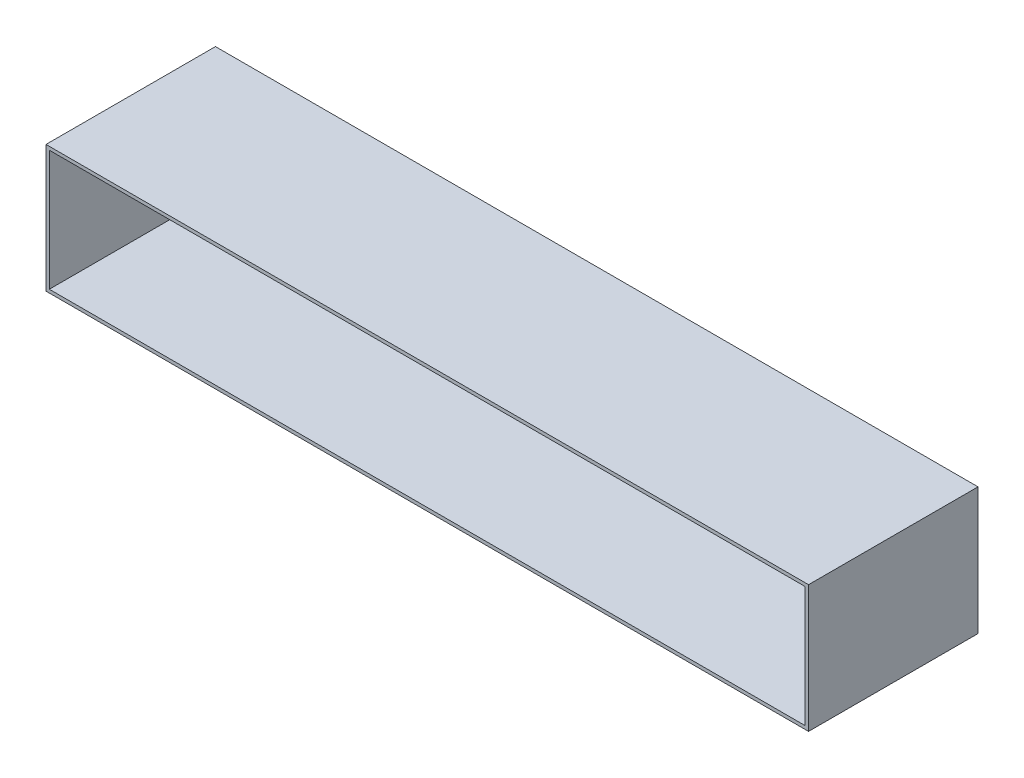
ISO-10303-21;
HEADER;
FILE_DESCRIPTION(('STEP AP214'),'2;1');
FILE_NAME('part.step','',(''),(''),'','','');
FILE_SCHEMA(('AUTOMOTIVE_DESIGN { 1 0 10303 214 1 1 1 1 }'));
ENDSEC;
DATA;
#1=APPLICATION_CONTEXT('core data for automotive mechanical design processes');
#2=APPLICATION_PROTOCOL_DEFINITION('international standard','automotive_design',2000,#1);
#3=PRODUCT_CONTEXT('',#1,'mechanical');
#4=PRODUCT('Part','Part','',(#3));
#5=PRODUCT_RELATED_PRODUCT_CATEGORY('part','',(#4));
#6=PRODUCT_DEFINITION_FORMATION('','',#4);
#7=PRODUCT_DEFINITION_CONTEXT('part definition',#1,'design');
#8=PRODUCT_DEFINITION('design','',#6,#7);
#9=PRODUCT_DEFINITION_SHAPE('','',#8);
#10=(LENGTH_UNIT() NAMED_UNIT(*) SI_UNIT(.MILLI.,.METRE.));
#11=(NAMED_UNIT(*) PLANE_ANGLE_UNIT() SI_UNIT($,.RADIAN.));
#12=(NAMED_UNIT(*) SI_UNIT($,.STERADIAN.) SOLID_ANGLE_UNIT());
#13=UNCERTAINTY_MEASURE_WITH_UNIT(LENGTH_MEASURE(1.E-05),#10,'distance_accuracy_value','');
#14=(GEOMETRIC_REPRESENTATION_CONTEXT(3) GLOBAL_UNCERTAINTY_ASSIGNED_CONTEXT((#13)) GLOBAL_UNIT_ASSIGNED_CONTEXT((#10,
#11,#12)) REPRESENTATION_CONTEXT('',''));
#15=CARTESIAN_POINT('',(0.,0.,0.));
#16=DIRECTION('',(0.,0.,1.));
#17=DIRECTION('',(1.,0.,0.));
#18=AXIS2_PLACEMENT_3D('',#15,#16,#17);
#19=CARTESIAN_POINT('',(0.,0.,50.8));
#20=DIRECTION('',(0.,0.,1.));
#21=DIRECTION('',(1.,0.,0.));
#22=AXIS2_PLACEMENT_3D('',#19,#20,#21);
#23=PLANE('',#22);
#24=DIRECTION('',(0.,1.,0.));
#25=VECTOR('',#24,1.);
#26=CARTESIAN_POINT('',(228.6,38.1,50.8));
#27=LINE('',#26,#25);
#28=CARTESIAN_POINT('',(228.6,-38.1,50.8));
#29=VERTEX_POINT('',#28);
#30=CARTESIAN_POINT('',(228.6,38.1,50.8));
#31=VERTEX_POINT('',#30);
#32=EDGE_CURVE('E136',#29,#31,#27,.T.);
#33=ORIENTED_EDGE('',*,*,#32,.T.);
#34=DIRECTION('',(-1.,0.,0.));
#35=VECTOR('',#34,1.);
#36=CARTESIAN_POINT('',(-228.6,38.1,50.8));
#37=LINE('',#36,#35);
#38=CARTESIAN_POINT('',(-228.6,38.1,50.8));
#39=VERTEX_POINT('',#38);
#40=EDGE_CURVE('E139',#31,#39,#37,.T.);
#41=ORIENTED_EDGE('',*,*,#40,.T.);
#42=DIRECTION('',(0.,-1.,0.));
#43=VECTOR('',#42,1.);
#44=CARTESIAN_POINT('',(-228.6,38.1,50.8));
#45=LINE('',#44,#43);
#46=CARTESIAN_POINT('',(-228.6,-38.1,50.8));
#47=VERTEX_POINT('',#46);
#48=EDGE_CURVE('E142',#39,#47,#45,.T.);
#49=ORIENTED_EDGE('',*,*,#48,.T.);
#50=DIRECTION('',(1.,0.,0.));
#51=VECTOR('',#50,1.);
#52=CARTESIAN_POINT('',(-228.6,-38.1,50.8));
#53=LINE('',#52,#51);
#54=EDGE_CURVE('E144',#47,#29,#53,.T.);
#55=ORIENTED_EDGE('',*,*,#54,.T.);
#56=EDGE_LOOP('',(#33,#41,#49,#55));
#57=FACE_BOUND('',#56,.T.);
#58=DIRECTION('',(1.,0.,0.));
#59=VECTOR('',#58,1.);
#60=CARTESIAN_POINT('',(-226.6,-36.1,50.8));
#61=LINE('',#60,#59);
#62=CARTESIAN_POINT('',(-226.6,-36.1,50.8));
#63=VERTEX_POINT('',#62);
#64=CARTESIAN_POINT('',(226.6,-36.1,50.8));
#65=VERTEX_POINT('',#64);
#66=EDGE_CURVE('E108',#63,#65,#61,.T.);
#67=ORIENTED_EDGE('',*,*,#66,.F.);
#68=DIRECTION('',(0.,-1.,0.));
#69=VECTOR('',#68,1.);
#70=CARTESIAN_POINT('',(-226.6,36.1,50.8));
#71=LINE('',#70,#69);
#72=CARTESIAN_POINT('',(-226.6,36.1,50.8));
#73=VERTEX_POINT('',#72);
#74=EDGE_CURVE('E100',#73,#63,#71,.T.);
#75=ORIENTED_EDGE('',*,*,#74,.F.);
#76=DIRECTION('',(-1.,0.,0.));
#77=VECTOR('',#76,1.);
#78=CARTESIAN_POINT('',(-226.6,36.1,50.8));
#79=LINE('',#78,#77);
#80=CARTESIAN_POINT('',(226.6,36.1,50.8));
#81=VERTEX_POINT('',#80);
#82=EDGE_CURVE('E122',#81,#73,#79,.T.);
#83=ORIENTED_EDGE('',*,*,#82,.F.);
#84=DIRECTION('',(0.,1.,0.));
#85=VECTOR('',#84,1.);
#86=CARTESIAN_POINT('',(226.6,36.1,50.8));
#87=LINE('',#86,#85);
#88=EDGE_CURVE('E120',#65,#81,#87,.T.);
#89=ORIENTED_EDGE('',*,*,#88,.F.);
#90=EDGE_LOOP('',(#67,#75,#83,#89));
#91=FACE_BOUND('',#90,.T.);
#92=ADVANCED_FACE('F35',(#57,#91),#23,.T.);
#93=CARTESIAN_POINT('',(0.,0.,-50.8));
#94=DIRECTION('',(0.,0.,1.));
#95=DIRECTION('',(1.,0.,0.));
#96=AXIS2_PLACEMENT_3D('',#93,#94,#95);
#97=PLANE('',#96);
#98=DIRECTION('',(0.,1.,0.));
#99=VECTOR('',#98,1.);
#100=CARTESIAN_POINT('',(228.6,38.1,-50.8));
#101=LINE('',#100,#99);
#102=CARTESIAN_POINT('',(228.6,-38.1,-50.8));
#103=VERTEX_POINT('',#102);
#104=CARTESIAN_POINT('',(228.6,38.1,-50.8));
#105=VERTEX_POINT('',#104);
#106=EDGE_CURVE('E116',#103,#105,#101,.T.);
#107=ORIENTED_EDGE('',*,*,#106,.F.);
#108=DIRECTION('',(1.,0.,0.));
#109=VECTOR('',#108,1.);
#110=CARTESIAN_POINT('',(-228.6,-38.1,-50.8));
#111=LINE('',#110,#109);
#112=CARTESIAN_POINT('',(-228.6,-38.1,-50.8));
#113=VERTEX_POINT('',#112);
#114=EDGE_CURVE('E140',#113,#103,#111,.T.);
#115=ORIENTED_EDGE('',*,*,#114,.F.);
#116=DIRECTION('',(0.,-1.,0.));
#117=VECTOR('',#116,1.);
#118=CARTESIAN_POINT('',(-228.6,38.1,-50.8));
#119=LINE('',#118,#117);
#120=CARTESIAN_POINT('',(-228.6,38.1,-50.8));
#121=VERTEX_POINT('',#120);
#122=EDGE_CURVE('E151',#121,#113,#119,.T.);
#123=ORIENTED_EDGE('',*,*,#122,.F.);
#124=DIRECTION('',(-1.,0.,0.));
#125=VECTOR('',#124,1.);
#126=CARTESIAN_POINT('',(-228.6,38.1,-50.8));
#127=LINE('',#126,#125);
#128=EDGE_CURVE('E149',#105,#121,#127,.T.);
#129=ORIENTED_EDGE('',*,*,#128,.F.);
#130=EDGE_LOOP('',(#107,#115,#123,#129));
#131=FACE_BOUND('',#130,.T.);
#132=DIRECTION('',(0.,-1.,0.));
#133=VECTOR('',#132,1.);
#134=CARTESIAN_POINT('',(-226.6,36.1,-50.8));
#135=LINE('',#134,#133);
#136=CARTESIAN_POINT('',(-226.6,36.1,-50.8));
#137=VERTEX_POINT('',#136);
#138=CARTESIAN_POINT('',(-226.6,-36.1,-50.8));
#139=VERTEX_POINT('',#138);
#140=EDGE_CURVE('E58',#137,#139,#135,.T.);
#141=ORIENTED_EDGE('',*,*,#140,.T.);
#142=DIRECTION('',(1.,0.,0.));
#143=VECTOR('',#142,1.);
#144=CARTESIAN_POINT('',(-226.6,-36.1,-50.8));
#145=LINE('',#144,#143);
#146=CARTESIAN_POINT('',(226.6,-36.1,-50.8));
#147=VERTEX_POINT('',#146);
#148=EDGE_CURVE('E115',#139,#147,#145,.T.);
#149=ORIENTED_EDGE('',*,*,#148,.T.);
#150=DIRECTION('',(0.,1.,0.));
#151=VECTOR('',#150,1.);
#152=CARTESIAN_POINT('',(226.6,36.1,-50.8));
#153=LINE('',#152,#151);
#154=CARTESIAN_POINT('',(226.6,36.1,-50.8));
#155=VERTEX_POINT('',#154);
#156=EDGE_CURVE('E128',#147,#155,#153,.T.);
#157=ORIENTED_EDGE('',*,*,#156,.T.);
#158=DIRECTION('',(-1.,0.,0.));
#159=VECTOR('',#158,1.);
#160=CARTESIAN_POINT('',(-226.6,36.1,-50.8));
#161=LINE('',#160,#159);
#162=EDGE_CURVE('E109',#155,#137,#161,.T.);
#163=ORIENTED_EDGE('',*,*,#162,.T.);
#164=EDGE_LOOP('',(#141,#149,#157,#163));
#165=FACE_BOUND('',#164,.T.);
#166=ADVANCED_FACE('F169',(#131,#165),#97,.F.);
#167=CARTESIAN_POINT('',(228.6,38.1,50.8));
#168=DIRECTION('',(-1.,0.,0.));
#169=DIRECTION('',(0.,0.,1.));
#170=AXIS2_PLACEMENT_3D('',#167,#168,#169);
#171=PLANE('',#170);
#172=ORIENTED_EDGE('',*,*,#106,.T.);
#173=DIRECTION('',(0.,0.,-1.));
#174=VECTOR('',#173,1.);
#175=CARTESIAN_POINT('',(228.6,38.1,50.8));
#176=LINE('',#175,#174);
#177=EDGE_CURVE('E11',#31,#105,#176,.T.);
#178=ORIENTED_EDGE('',*,*,#177,.F.);
#179=ORIENTED_EDGE('',*,*,#32,.F.);
#180=DIRECTION('',(0.,0.,-1.));
#181=VECTOR('',#180,1.);
#182=CARTESIAN_POINT('',(228.6,-38.1,50.8));
#183=LINE('',#182,#181);
#184=EDGE_CURVE('E146',#29,#103,#183,.T.);
#185=ORIENTED_EDGE('',*,*,#184,.T.);
#186=EDGE_LOOP('',(#172,#178,#179,#185));
#187=FACE_BOUND('',#186,.T.);
#188=ADVANCED_FACE('F37',(#187),#171,.F.);
#189=CARTESIAN_POINT('',(-228.6,38.1,50.8));
#190=DIRECTION('',(0.,-1.,0.));
#191=DIRECTION('',(0.,0.,-1.));
#192=AXIS2_PLACEMENT_3D('',#189,#190,#191);
#193=PLANE('',#192);
#194=ORIENTED_EDGE('',*,*,#128,.T.);
#195=DIRECTION('',(0.,0.,-1.));
#196=VECTOR('',#195,1.);
#197=CARTESIAN_POINT('',(-228.6,38.1,50.8));
#198=LINE('',#197,#196);
#199=EDGE_CURVE('E43',#39,#121,#198,.T.);
#200=ORIENTED_EDGE('',*,*,#199,.F.);
#201=ORIENTED_EDGE('',*,*,#40,.F.);
#202=ORIENTED_EDGE('',*,*,#177,.T.);
#203=EDGE_LOOP('',(#194,#200,#201,#202));
#204=FACE_BOUND('',#203,.T.);
#205=ADVANCED_FACE('F179',(#204),#193,.F.);
#206=CARTESIAN_POINT('',(-228.6,38.1,50.8));
#207=DIRECTION('',(1.,0.,0.));
#208=DIRECTION('',(0.,1.,0.));
#209=AXIS2_PLACEMENT_3D('',#206,#207,#208);
#210=PLANE('',#209);
#211=ORIENTED_EDGE('',*,*,#122,.T.);
#212=DIRECTION('',(0.,0.,-1.));
#213=VECTOR('',#212,1.);
#214=CARTESIAN_POINT('',(-228.6,-38.1,50.8));
#215=LINE('',#214,#213);
#216=EDGE_CURVE('E156',#47,#113,#215,.T.);
#217=ORIENTED_EDGE('',*,*,#216,.F.);
#218=ORIENTED_EDGE('',*,*,#48,.F.);
#219=ORIENTED_EDGE('',*,*,#199,.T.);
#220=EDGE_LOOP('',(#211,#217,#218,#219));
#221=FACE_BOUND('',#220,.T.);
#222=ADVANCED_FACE('F163',(#221),#210,.F.);
#223=CARTESIAN_POINT('',(-228.6,-38.1,50.8));
#224=DIRECTION('',(0.,1.,0.));
#225=DIRECTION('',(0.,0.,1.));
#226=AXIS2_PLACEMENT_3D('',#223,#224,#225);
#227=PLANE('',#226);
#228=ORIENTED_EDGE('',*,*,#114,.T.);
#229=ORIENTED_EDGE('',*,*,#184,.F.);
#230=ORIENTED_EDGE('',*,*,#54,.F.);
#231=ORIENTED_EDGE('',*,*,#216,.T.);
#232=EDGE_LOOP('',(#228,#229,#230,#231));
#233=FACE_BOUND('',#232,.T.);
#234=ADVANCED_FACE('F173',(#233),#227,.F.);
#235=CARTESIAN_POINT('',(-226.6,36.1,50.8));
#236=DIRECTION('',(1.,0.,0.));
#237=DIRECTION('',(0.,0.,-1.));
#238=AXIS2_PLACEMENT_3D('',#235,#236,#237);
#239=PLANE('',#238);
#240=ORIENTED_EDGE('',*,*,#140,.F.);
#241=DIRECTION('',(0.,0.,-1.));
#242=VECTOR('',#241,1.);
#243=CARTESIAN_POINT('',(-226.6,36.1,50.8));
#244=LINE('',#243,#242);
#245=EDGE_CURVE('E104',#73,#137,#244,.T.);
#246=ORIENTED_EDGE('',*,*,#245,.F.);
#247=ORIENTED_EDGE('',*,*,#74,.T.);
#248=DIRECTION('',(0.,0.,-1.));
#249=VECTOR('',#248,1.);
#250=CARTESIAN_POINT('',(-226.6,-36.1,50.8));
#251=LINE('',#250,#249);
#252=EDGE_CURVE('E103',#63,#139,#251,.T.);
#253=ORIENTED_EDGE('',*,*,#252,.T.);
#254=EDGE_LOOP('',(#240,#246,#247,#253));
#255=FACE_BOUND('',#254,.T.);
#256=ADVANCED_FACE('F102',(#255),#239,.T.);
#257=CARTESIAN_POINT('',(-226.6,-36.1,50.8));
#258=DIRECTION('',(0.,1.,0.));
#259=DIRECTION('',(0.,0.,1.));
#260=AXIS2_PLACEMENT_3D('',#257,#258,#259);
#261=PLANE('',#260);
#262=ORIENTED_EDGE('',*,*,#148,.F.);
#263=ORIENTED_EDGE('',*,*,#252,.F.);
#264=ORIENTED_EDGE('',*,*,#66,.T.);
#265=DIRECTION('',(0.,0.,-1.));
#266=VECTOR('',#265,1.);
#267=CARTESIAN_POINT('',(226.6,-36.1,50.8));
#268=LINE('',#267,#266);
#269=EDGE_CURVE('E117',#65,#147,#268,.T.);
#270=ORIENTED_EDGE('',*,*,#269,.T.);
#271=EDGE_LOOP('',(#262,#263,#264,#270));
#272=FACE_BOUND('',#271,.T.);
#273=ADVANCED_FACE('F112',(#272),#261,.T.);
#274=CARTESIAN_POINT('',(226.6,36.1,50.8));
#275=DIRECTION('',(-1.,0.,0.));
#276=DIRECTION('',(0.,0.,1.));
#277=AXIS2_PLACEMENT_3D('',#274,#275,#276);
#278=PLANE('',#277);
#279=ORIENTED_EDGE('',*,*,#156,.F.);
#280=ORIENTED_EDGE('',*,*,#269,.F.);
#281=ORIENTED_EDGE('',*,*,#88,.T.);
#282=DIRECTION('',(0.,0.,-1.));
#283=VECTOR('',#282,1.);
#284=CARTESIAN_POINT('',(226.6,36.1,50.8));
#285=LINE('',#284,#283);
#286=EDGE_CURVE('E50',#81,#155,#285,.T.);
#287=ORIENTED_EDGE('',*,*,#286,.T.);
#288=EDGE_LOOP('',(#279,#280,#281,#287));
#289=FACE_BOUND('',#288,.T.);
#290=ADVANCED_FACE('F202',(#289),#278,.T.);
#291=CARTESIAN_POINT('',(-226.6,36.1,50.8));
#292=DIRECTION('',(0.,-1.,0.));
#293=DIRECTION('',(0.,0.,-1.));
#294=AXIS2_PLACEMENT_3D('',#291,#292,#293);
#295=PLANE('',#294);
#296=ORIENTED_EDGE('',*,*,#162,.F.);
#297=ORIENTED_EDGE('',*,*,#286,.F.);
#298=ORIENTED_EDGE('',*,*,#82,.T.);
#299=ORIENTED_EDGE('',*,*,#245,.T.);
#300=EDGE_LOOP('',(#296,#297,#298,#299));
#301=FACE_BOUND('',#300,.T.);
#302=ADVANCED_FACE('F206',(#301),#295,.T.);
#303=CLOSED_SHELL('',(#92,#166,#188,#205,#222,#234,#256,#273,#290,#302));
#304=MANIFOLD_SOLID_BREP('B2',#303);
#305=ADVANCED_BREP_SHAPE_REPRESENTATION('',(#18,#304),#14);
#306=SHAPE_DEFINITION_REPRESENTATION(#9,#305);
ENDSEC;
END-ISO-10303-21;
